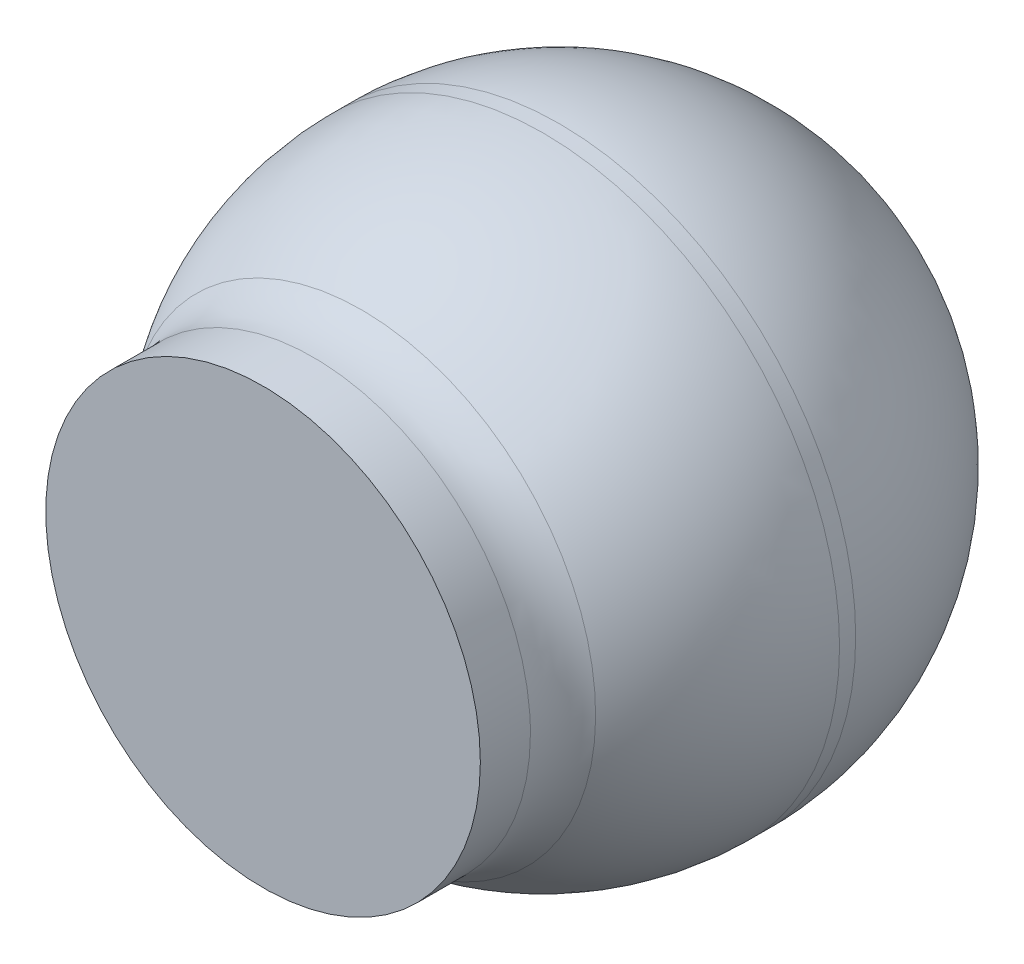
ISO-10303-21;
HEADER;
FILE_DESCRIPTION(('STEP AP214'),'2;1');
FILE_NAME('part.step','',(''),(''),'','','');
FILE_SCHEMA(('AUTOMOTIVE_DESIGN { 1 0 10303 214 1 1 1 1 }'));
ENDSEC;
DATA;
#1=APPLICATION_CONTEXT('core data for automotive mechanical design processes');
#2=APPLICATION_PROTOCOL_DEFINITION('international standard','automotive_design',2000,#1);
#3=PRODUCT_CONTEXT('',#1,'mechanical');
#4=PRODUCT('Part','Part','',(#3));
#5=PRODUCT_RELATED_PRODUCT_CATEGORY('part','',(#4));
#6=PRODUCT_DEFINITION_FORMATION('','',#4);
#7=PRODUCT_DEFINITION_CONTEXT('part definition',#1,'design');
#8=PRODUCT_DEFINITION('design','',#6,#7);
#9=PRODUCT_DEFINITION_SHAPE('','',#8);
#10=(LENGTH_UNIT() NAMED_UNIT(*) SI_UNIT(.MILLI.,.METRE.));
#11=(NAMED_UNIT(*) PLANE_ANGLE_UNIT() SI_UNIT($,.RADIAN.));
#12=(NAMED_UNIT(*) SI_UNIT($,.STERADIAN.) SOLID_ANGLE_UNIT());
#13=UNCERTAINTY_MEASURE_WITH_UNIT(LENGTH_MEASURE(1.E-05),#10,'distance_accuracy_value','');
#14=(GEOMETRIC_REPRESENTATION_CONTEXT(3) GLOBAL_UNCERTAINTY_ASSIGNED_CONTEXT((#13)) GLOBAL_UNIT_ASSIGNED_CONTEXT((#10,
#11,#12)) REPRESENTATION_CONTEXT('',''));
#15=CARTESIAN_POINT('',(0.,0.,0.));
#16=DIRECTION('',(0.,0.,1.));
#17=DIRECTION('',(1.,0.,0.));
#18=AXIS2_PLACEMENT_3D('',#15,#16,#17);
#19=CARTESIAN_POINT('',(-1.832919922269,-1.511349291452,10.006534503384));
#20=DIRECTION('',(0.,0.,-1.));
#21=DIRECTION('',(-1.,0.,0.));
#22=AXIS2_PLACEMENT_3D('',#19,#20,#21);
#23=PLANE('',#22);
#24=CARTESIAN_POINT('',(-1.832919922269,-1.511349291452,10.006534503384));
#25=DIRECTION('',(0.,0.,1.));
#26=DIRECTION('',(1.,0.,0.));
#27=AXIS2_PLACEMENT_3D('',#24,#25,#26);
#28=CIRCLE('',#27,0.275);
#29=CARTESIAN_POINT('',(-1.557919922269,-1.511349291452,10.006534503384));
#30=VERTEX_POINT('',#29);
#31=EDGE_CURVE('E20',#30,#30,#28,.F.);
#32=ORIENTED_EDGE('',*,*,#31,.F.);
#33=EDGE_LOOP('',(#32));
#34=FACE_BOUND('',#33,.T.);
#35=ADVANCED_FACE('F17',(#34),#23,.F.);
#36=CARTESIAN_POINT('',(-1.832919922269,-1.511349291452,9.906534503384));
#37=DIRECTION('',(0.,0.,1.));
#38=DIRECTION('',(1.,0.,0.));
#39=AXIS2_PLACEMENT_3D('',#36,#37,#38);
#40=CYLINDRICAL_SURFACE('',#39,0.275);
#41=CARTESIAN_POINT('',(-1.832919922269,-1.511349291452,9.943180457728));
#42=DIRECTION('',(0.,0.,-1.));
#43=DIRECTION('',(0.996700902337582,0.0811622527992461,0.));
#44=AXIS2_PLACEMENT_3D('',#41,#42,#43);
#45=CIRCLE('',#44,0.275);
#46=CARTESIAN_POINT('',(-1.55882717412616,-1.48902967193221,9.943180457728));
#47=VERTEX_POINT('',#46);
#48=EDGE_CURVE('E65',#47,#47,#45,.F.);
#49=ORIENTED_EDGE('',*,*,#48,.T.);
#50=EDGE_LOOP('',(#49));
#51=FACE_BOUND('',#50,.T.);
#52=ORIENTED_EDGE('',*,*,#31,.T.);
#53=EDGE_LOOP('',(#52));
#54=FACE_BOUND('',#53,.T.);
#55=ADVANCED_FACE('F62',(#51,#54),#40,.T.);
#56=CARTESIAN_POINT('',(-1.832919922269,-1.511349291452,9.943180457728));
#57=DIRECTION('',(0.,0.,-1.));
#58=DIRECTION('',(0.996700902337583,0.081162252799246,0.));
#59=AXIS2_PLACEMENT_3D('',#56,#57,#58);
#60=TOROIDAL_SURFACE('',#59,0.375,0.1);
#61=ORIENTED_EDGE('',*,*,#48,.F.);
#62=EDGE_LOOP('',(#61));
#63=FACE_BOUND('',#62,.T.);
#64=CARTESIAN_POINT('',(-1.832919922269,-1.511349291452,9.881744931236));
#65=DIRECTION('',(0.,0.,-1.));
#66=DIRECTION('',(-0.996700902337597,-0.0811622527990614,0.));
#67=AXIS2_PLACEMENT_3D('',#64,#65,#66);
#68=CIRCLE('',#67,0.296097046412665);
#69=CARTESIAN_POINT('',(-2.128040115608,-1.535381194786,9.881744931236));
#70=VERTEX_POINT('',#69);
#71=EDGE_CURVE('E39',#70,#70,#68,.T.);
#72=ORIENTED_EDGE('',*,*,#71,.F.);
#73=EDGE_LOOP('',(#72));
#74=FACE_BOUND('',#73,.T.);
#75=ADVANCED_FACE('F57',(#63,#74),#60,.F.);
#76=CARTESIAN_POINT('',(-2.206682760645,-1.541785136252,9.651976062157));
#77=CARTESIAN_POINT('',(-2.206682760645,-1.541785136252,9.701461392103));
#78=CARTESIAN_POINT('',(-2.198526217348,-1.541120941579,9.750947004335));
#79=CARTESIAN_POINT('',(-2.182207085349,-1.539792059952,9.798626332798));
#80=CARTESIAN_POINT('',(-2.158341390838,-1.537848654938,9.842699544317));
#81=CARTESIAN_POINT('',(-2.128040115608,-1.535381194786,9.881744931236));
#82=(BOUNDED_CURVE() B_SPLINE_CURVE(5,(#76,#77,#78,#79,#80,#81),.UNSPECIFIED.,.F.,
.F.) B_SPLINE_CURVE_WITH_KNOTS((6,6),(0.,0.661568582165),
.UNSPECIFIED.) CURVE() GEOMETRIC_REPRESENTATION_ITEM() RATIONAL_B_SPLINE_CURVE((1.,1.,1.,1.,1.,1.)) REPRESENTATION_ITEM(''));
#83=CARTESIAN_POINT('',(-1.832919922269,-1.511349291452,9.651976062157));
#84=DIRECTION('',(0.,0.,-1.));
#85=AXIS1_PLACEMENT('',#83,#84);
#86=SURFACE_OF_REVOLUTION('',#82,#85);
#87=CARTESIAN_POINT('',(-1.832919922269,-1.511349291452,9.651976062157));
#88=DIRECTION('',(0.,0.,1.));
#89=DIRECTION('',(1.,0.,0.));
#90=AXIS2_PLACEMENT_3D('',#87,#88,#89);
#91=CIRCLE('',#90,0.375);
#92=CARTESIAN_POINT('',(-1.457919922269,-1.511349291452,9.651976062157));
#93=VERTEX_POINT('',#92);
#94=EDGE_CURVE('E36',#93,#93,#91,.F.);
#95=ORIENTED_EDGE('',*,*,#94,.F.);
#96=EDGE_LOOP('',(#95));
#97=FACE_BOUND('',#96,.T.);
#98=ORIENTED_EDGE('',*,*,#71,.T.);
#99=EDGE_LOOP('',(#98));
#100=FACE_BOUND('',#99,.T.);
#101=ADVANCED_FACE('F53',(#97,#100),#86,.F.);
#102=CARTESIAN_POINT('',(-1.832919922269,-1.511349291452,9.256534503384));
#103=DIRECTION('',(0.,0.,1.));
#104=DIRECTION('',(1.,0.,0.));
#105=AXIS2_PLACEMENT_3D('',#102,#103,#104);
#106=CYLINDRICAL_SURFACE('',#105,0.375);
#107=CARTESIAN_POINT('',(-1.832919922269,-1.511349291452,9.631534503384));
#108=DIRECTION('',(0.,0.,-1.));
#109=DIRECTION('',(0.0811622527992362,-0.996700902337583,0.));
#110=AXIS2_PLACEMENT_3D('',#107,#108,#109);
#111=CIRCLE('',#110,0.375);
#112=CARTESIAN_POINT('',(-1.80248407746929,-1.88511212982859,9.631534503384));
#113=VERTEX_POINT('',#112);
#114=CARTESIAN_POINT('',(-1.86335576706871,-1.13758645307541,9.631534503384));
#115=VERTEX_POINT('',#114);
#116=EDGE_CURVE('E11',#113,#115,#111,.T.);
#117=ORIENTED_EDGE('',*,*,#116,.F.);
#118=CARTESIAN_POINT('',(-1.832919922269,-1.511349291452,9.631534503384));
#119=DIRECTION('',(0.,0.,1.));
#120=DIRECTION('',(0.081162252799236,-0.996700902337583,0.));
#121=AXIS2_PLACEMENT_3D('',#118,#119,#120);
#122=CIRCLE('',#121,0.375);
#123=EDGE_CURVE('E25',#115,#113,#122,.F.);
#124=ORIENTED_EDGE('',*,*,#123,.F.);
#125=EDGE_LOOP('',(#117,#124));
#126=FACE_BOUND('',#125,.T.);
#127=ORIENTED_EDGE('',*,*,#94,.T.);
#128=EDGE_LOOP('',(#127));
#129=FACE_BOUND('',#128,.T.);
#130=ADVANCED_FACE('F34',(#126,#129),#106,.T.);
#131=CARTESIAN_POINT('',(-1.832919922269,-1.511349291452,9.631534503384));
#132=DIRECTION('',(0.0811622527992361,-0.996700902337583,0.));
#133=DIRECTION('',(-0.996700902337583,-0.0811622527992361,0.));
#134=AXIS2_PLACEMENT_3D('',#131,#132,#133);
#135=SPHERICAL_SURFACE('',#134,0.375);
#136=ORIENTED_EDGE('',*,*,#123,.T.);
#137=ORIENTED_EDGE('',*,*,#116,.T.);
#138=EDGE_LOOP('',(#136,#137));
#139=FACE_BOUND('',#138,.T.);
#140=ADVANCED_FACE('F32',(#139),#135,.T.);
#141=CLOSED_SHELL('',(#35,#55,#75,#101,#130,#140));
#142=MANIFOLD_SOLID_BREP('B1',#141);
#143=ADVANCED_BREP_SHAPE_REPRESENTATION('',(#18,#142),#14);
#144=SHAPE_DEFINITION_REPRESENTATION(#9,#143);
ENDSEC;
END-ISO-10303-21;
